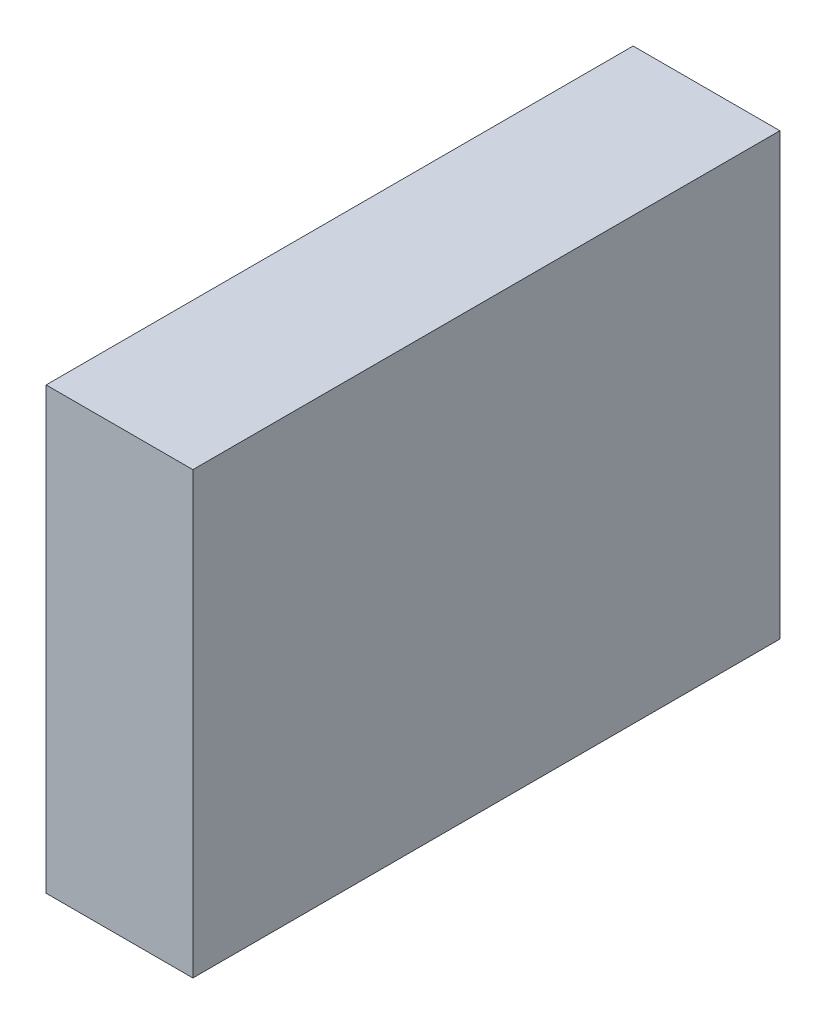
ISO-10303-21;
HEADER;
FILE_DESCRIPTION(('STEP AP214'),'2;1');
FILE_NAME('part.step','',(''),(''),'','','');
FILE_SCHEMA(('AUTOMOTIVE_DESIGN { 1 0 10303 214 1 1 1 1 }'));
ENDSEC;
DATA;
#1=APPLICATION_CONTEXT('core data for automotive mechanical design processes');
#2=APPLICATION_PROTOCOL_DEFINITION('international standard','automotive_design',2000,#1);
#3=PRODUCT_CONTEXT('',#1,'mechanical');
#4=PRODUCT('Part','Part','',(#3));
#5=PRODUCT_RELATED_PRODUCT_CATEGORY('part','',(#4));
#6=PRODUCT_DEFINITION_FORMATION('','',#4);
#7=PRODUCT_DEFINITION_CONTEXT('part definition',#1,'design');
#8=PRODUCT_DEFINITION('design','',#6,#7);
#9=PRODUCT_DEFINITION_SHAPE('','',#8);
#10=(LENGTH_UNIT() NAMED_UNIT(*) SI_UNIT(.MILLI.,.METRE.));
#11=(NAMED_UNIT(*) PLANE_ANGLE_UNIT() SI_UNIT($,.RADIAN.));
#12=(NAMED_UNIT(*) SI_UNIT($,.STERADIAN.) SOLID_ANGLE_UNIT());
#13=UNCERTAINTY_MEASURE_WITH_UNIT(LENGTH_MEASURE(1.E-05),#10,'distance_accuracy_value','');
#14=(GEOMETRIC_REPRESENTATION_CONTEXT(3) GLOBAL_UNCERTAINTY_ASSIGNED_CONTEXT((#13)) GLOBAL_UNIT_ASSIGNED_CONTEXT((#10,
#11,#12)) REPRESENTATION_CONTEXT('',''));
#15=CARTESIAN_POINT('',(0.,0.,0.));
#16=DIRECTION('',(0.,0.,1.));
#17=DIRECTION('',(1.,0.,0.));
#18=AXIS2_PLACEMENT_3D('',#15,#16,#17);
#19=CARTESIAN_POINT('',(0.,30.,0.));
#20=DIRECTION('',(1.,0.,0.));
#21=DIRECTION('',(0.,0.,-1.));
#22=AXIS2_PLACEMENT_3D('',#19,#20,#21);
#23=PLANE('',#22);
#24=DIRECTION('',(0.,0.,1.));
#25=VECTOR('',#24,1.);
#26=CARTESIAN_POINT('',(0.,0.,0.));
#27=LINE('',#26,#25);
#28=CARTESIAN_POINT('',(0.,0.,-40.));
#29=VERTEX_POINT('',#28);
#30=CARTESIAN_POINT('',(0.,0.,0.));
#31=VERTEX_POINT('',#30);
#32=EDGE_CURVE('E96',#29,#31,#27,.T.);
#33=ORIENTED_EDGE('',*,*,#32,.T.);
#34=DIRECTION('',(0.,-1.,0.));
#35=VECTOR('',#34,1.);
#36=CARTESIAN_POINT('',(0.,30.,0.));
#37=LINE('',#36,#35);
#38=CARTESIAN_POINT('',(0.,30.,0.));
#39=VERTEX_POINT('',#38);
#40=EDGE_CURVE('E11',#39,#31,#37,.T.);
#41=ORIENTED_EDGE('',*,*,#40,.F.);
#42=DIRECTION('',(0.,0.,1.));
#43=VECTOR('',#42,1.);
#44=CARTESIAN_POINT('',(0.,30.,0.));
#45=LINE('',#44,#43);
#46=CARTESIAN_POINT('',(0.,30.,-40.));
#47=VERTEX_POINT('',#46);
#48=EDGE_CURVE('E84',#47,#39,#45,.T.);
#49=ORIENTED_EDGE('',*,*,#48,.F.);
#50=DIRECTION('',(0.,-1.,0.));
#51=VECTOR('',#50,1.);
#52=CARTESIAN_POINT('',(0.,30.,-40.));
#53=LINE('',#52,#51);
#54=EDGE_CURVE('E92',#47,#29,#53,.T.);
#55=ORIENTED_EDGE('',*,*,#54,.T.);
#56=EDGE_LOOP('',(#33,#41,#49,#55));
#57=FACE_BOUND('',#56,.T.);
#58=ADVANCED_FACE('F33',(#57),#23,.F.);
#59=CARTESIAN_POINT('',(0.,30.,0.));
#60=DIRECTION('',(0.,0.,-1.));
#61=DIRECTION('',(-1.,0.,0.));
#62=AXIS2_PLACEMENT_3D('',#59,#60,#61);
#63=PLANE('',#62);
#64=DIRECTION('',(1.,0.,0.));
#65=VECTOR('',#64,1.);
#66=CARTESIAN_POINT('',(0.,0.,0.));
#67=LINE('',#66,#65);
#68=CARTESIAN_POINT('',(10.,0.,0.));
#69=VERTEX_POINT('',#68);
#70=EDGE_CURVE('E88',#31,#69,#67,.T.);
#71=ORIENTED_EDGE('',*,*,#70,.T.);
#72=DIRECTION('',(0.,-1.,0.));
#73=VECTOR('',#72,1.);
#74=CARTESIAN_POINT('',(10.,30.,0.));
#75=LINE('',#74,#73);
#76=CARTESIAN_POINT('',(10.,30.,0.));
#77=VERTEX_POINT('',#76);
#78=EDGE_CURVE('E41',#77,#69,#75,.T.);
#79=ORIENTED_EDGE('',*,*,#78,.F.);
#80=DIRECTION('',(1.,0.,0.));
#81=VECTOR('',#80,1.);
#82=CARTESIAN_POINT('',(0.,30.,0.));
#83=LINE('',#82,#81);
#84=EDGE_CURVE('E79',#39,#77,#83,.T.);
#85=ORIENTED_EDGE('',*,*,#84,.F.);
#86=ORIENTED_EDGE('',*,*,#40,.T.);
#87=EDGE_LOOP('',(#71,#79,#85,#86));
#88=FACE_BOUND('',#87,.T.);
#89=ADVANCED_FACE('F87',(#88),#63,.F.);
#90=CARTESIAN_POINT('',(10.,30.,0.));
#91=DIRECTION('',(-1.,0.,0.));
#92=DIRECTION('',(0.,0.,1.));
#93=AXIS2_PLACEMENT_3D('',#90,#91,#92);
#94=PLANE('',#93);
#95=DIRECTION('',(0.,0.,-1.));
#96=VECTOR('',#95,1.);
#97=CARTESIAN_POINT('',(10.,0.,0.));
#98=LINE('',#97,#96);
#99=CARTESIAN_POINT('',(9.99999999999999,0.,-40.));
#100=VERTEX_POINT('',#99);
#101=EDGE_CURVE('E66',#69,#100,#98,.T.);
#102=ORIENTED_EDGE('',*,*,#101,.T.);
#103=DIRECTION('',(0.,-1.,0.));
#104=VECTOR('',#103,1.);
#105=CARTESIAN_POINT('',(9.99999999999999,30.,-40.));
#106=LINE('',#105,#104);
#107=CARTESIAN_POINT('',(9.99999999999999,30.,-40.));
#108=VERTEX_POINT('',#107);
#109=EDGE_CURVE('E89',#108,#100,#106,.T.);
#110=ORIENTED_EDGE('',*,*,#109,.F.);
#111=DIRECTION('',(0.,0.,-1.));
#112=VECTOR('',#111,1.);
#113=CARTESIAN_POINT('',(10.,30.,0.));
#114=LINE('',#113,#112);
#115=EDGE_CURVE('E82',#77,#108,#114,.T.);
#116=ORIENTED_EDGE('',*,*,#115,.F.);
#117=ORIENTED_EDGE('',*,*,#78,.T.);
#118=EDGE_LOOP('',(#102,#110,#116,#117));
#119=FACE_BOUND('',#118,.T.);
#120=ADVANCED_FACE('F90',(#119),#94,.F.);
#121=CARTESIAN_POINT('',(0.,30.,-40.));
#122=DIRECTION('',(0.,0.,1.));
#123=DIRECTION('',(1.,0.,0.));
#124=AXIS2_PLACEMENT_3D('',#121,#122,#123);
#125=PLANE('',#124);
#126=DIRECTION('',(-1.,0.,0.));
#127=VECTOR('',#126,1.);
#128=CARTESIAN_POINT('',(0.,0.,-40.));
#129=LINE('',#128,#127);
#130=EDGE_CURVE('E72',#100,#29,#129,.T.);
#131=ORIENTED_EDGE('',*,*,#130,.T.);
#132=ORIENTED_EDGE('',*,*,#54,.F.);
#133=DIRECTION('',(-1.,0.,0.));
#134=VECTOR('',#133,1.);
#135=CARTESIAN_POINT('',(0.,30.,-40.));
#136=LINE('',#135,#134);
#137=EDGE_CURVE('E49',#108,#47,#136,.T.);
#138=ORIENTED_EDGE('',*,*,#137,.F.);
#139=ORIENTED_EDGE('',*,*,#109,.T.);
#140=EDGE_LOOP('',(#131,#132,#138,#139));
#141=FACE_BOUND('',#140,.T.);
#142=ADVANCED_FACE('F103',(#141),#125,.F.);
#143=CARTESIAN_POINT('',(0.,30.,0.));
#144=DIRECTION('',(0.,-1.,0.));
#145=DIRECTION('',(0.,0.,-1.));
#146=AXIS2_PLACEMENT_3D('',#143,#144,#145);
#147=PLANE('',#146);
#148=ORIENTED_EDGE('',*,*,#48,.T.);
#149=ORIENTED_EDGE('',*,*,#84,.T.);
#150=ORIENTED_EDGE('',*,*,#115,.T.);
#151=ORIENTED_EDGE('',*,*,#137,.T.);
#152=EDGE_LOOP('',(#148,#149,#150,#151));
#153=FACE_BOUND('',#152,.T.);
#154=ADVANCED_FACE('F80',(#153),#147,.F.);
#155=CARTESIAN_POINT('',(0.,0.,0.));
#156=DIRECTION('',(0.,-1.,0.));
#157=DIRECTION('',(0.,0.,-1.));
#158=AXIS2_PLACEMENT_3D('',#155,#156,#157);
#159=PLANE('',#158);
#160=ORIENTED_EDGE('',*,*,#32,.F.);
#161=ORIENTED_EDGE('',*,*,#130,.F.);
#162=ORIENTED_EDGE('',*,*,#101,.F.);
#163=ORIENTED_EDGE('',*,*,#70,.F.);
#164=EDGE_LOOP('',(#160,#161,#162,#163));
#165=FACE_BOUND('',#164,.T.);
#166=ADVANCED_FACE('F106',(#165),#159,.T.);
#167=CLOSED_SHELL('',(#58,#89,#120,#142,#154,#166));
#168=MANIFOLD_SOLID_BREP('B2',#167);
#169=ADVANCED_BREP_SHAPE_REPRESENTATION('',(#18,#168),#14);
#170=SHAPE_DEFINITION_REPRESENTATION(#9,#169);
ENDSEC;
END-ISO-10303-21;
